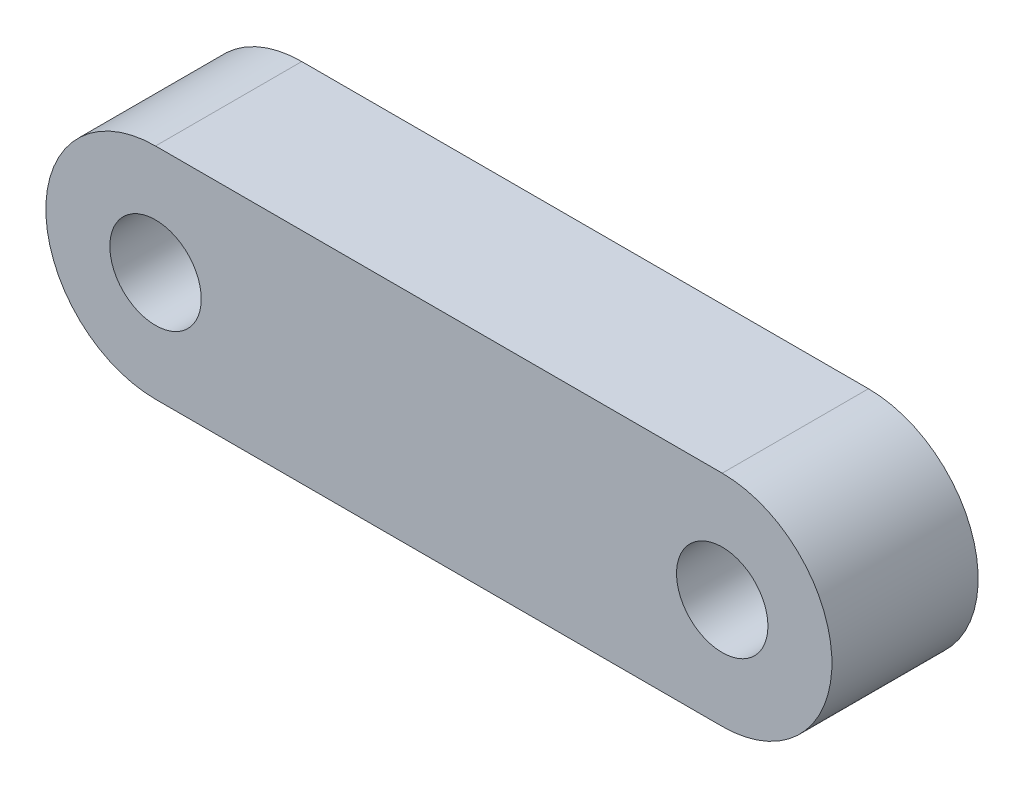
ISO-10303-21;
HEADER;
FILE_DESCRIPTION(('STEP AP214'),'2;1');
FILE_NAME('part.step','',(''),(''),'','','');
FILE_SCHEMA(('AUTOMOTIVE_DESIGN { 1 0 10303 214 1 1 1 1 }'));
ENDSEC;
DATA;
#1=APPLICATION_CONTEXT('core data for automotive mechanical design processes');
#2=APPLICATION_PROTOCOL_DEFINITION('international standard','automotive_design',2000,#1);
#3=PRODUCT_CONTEXT('',#1,'mechanical');
#4=PRODUCT('Part','Part','',(#3));
#5=PRODUCT_RELATED_PRODUCT_CATEGORY('part','',(#4));
#6=PRODUCT_DEFINITION_FORMATION('','',#4);
#7=PRODUCT_DEFINITION_CONTEXT('part definition',#1,'design');
#8=PRODUCT_DEFINITION('design','',#6,#7);
#9=PRODUCT_DEFINITION_SHAPE('','',#8);
#10=(LENGTH_UNIT() NAMED_UNIT(*) SI_UNIT(.MILLI.,.METRE.));
#11=(NAMED_UNIT(*) PLANE_ANGLE_UNIT() SI_UNIT($,.RADIAN.));
#12=(NAMED_UNIT(*) SI_UNIT($,.STERADIAN.) SOLID_ANGLE_UNIT());
#13=UNCERTAINTY_MEASURE_WITH_UNIT(LENGTH_MEASURE(1.E-05),#10,'distance_accuracy_value','');
#14=(GEOMETRIC_REPRESENTATION_CONTEXT(3) GLOBAL_UNCERTAINTY_ASSIGNED_CONTEXT((#13)) GLOBAL_UNIT_ASSIGNED_CONTEXT((#10,
#11,#12)) REPRESENTATION_CONTEXT('',''));
#15=CARTESIAN_POINT('',(0.,0.,0.));
#16=DIRECTION('',(0.,0.,1.));
#17=DIRECTION('',(1.,0.,0.));
#18=AXIS2_PLACEMENT_3D('',#15,#16,#17);
#19=CARTESIAN_POINT('',(-7.75,0.,4.));
#20=DIRECTION('',(0.,0.,-1.));
#21=DIRECTION('',(-1.,0.,0.));
#22=AXIS2_PLACEMENT_3D('',#19,#20,#21);
#23=CYLINDRICAL_SURFACE('',#22,3.);
#24=CARTESIAN_POINT('',(-7.75,0.,0.));
#25=DIRECTION('',(0.,0.,1.));
#26=DIRECTION('',(1.,0.,0.));
#27=AXIS2_PLACEMENT_3D('',#24,#25,#26);
#28=CIRCLE('',#27,3.);
#29=CARTESIAN_POINT('',(-7.75,3.,0.));
#30=VERTEX_POINT('',#29);
#31=CARTESIAN_POINT('',(-7.75,-3.,0.));
#32=VERTEX_POINT('',#31);
#33=EDGE_CURVE('E97',#30,#32,#28,.T.);
#34=ORIENTED_EDGE('',*,*,#33,.T.);
#35=DIRECTION('',(0.,0.,-1.));
#36=VECTOR('',#35,1.);
#37=CARTESIAN_POINT('',(-7.75,-3.,4.));
#38=LINE('',#37,#36);
#39=CARTESIAN_POINT('',(-7.75,-3.,4.));
#40=VERTEX_POINT('',#39);
#41=EDGE_CURVE('E11',#40,#32,#38,.T.);
#42=ORIENTED_EDGE('',*,*,#41,.F.);
#43=CARTESIAN_POINT('',(-7.75,0.,4.));
#44=DIRECTION('',(0.,0.,1.));
#45=DIRECTION('',(1.,0.,0.));
#46=AXIS2_PLACEMENT_3D('',#43,#44,#45);
#47=CIRCLE('',#46,3.);
#48=CARTESIAN_POINT('',(-7.75,3.,4.));
#49=VERTEX_POINT('',#48);
#50=EDGE_CURVE('E85',#49,#40,#47,.T.);
#51=ORIENTED_EDGE('',*,*,#50,.F.);
#52=DIRECTION('',(0.,0.,-1.));
#53=VECTOR('',#52,1.);
#54=CARTESIAN_POINT('',(-7.75,3.,4.));
#55=LINE('',#54,#53);
#56=EDGE_CURVE('E93',#49,#30,#55,.T.);
#57=ORIENTED_EDGE('',*,*,#56,.T.);
#58=EDGE_LOOP('',(#34,#42,#51,#57));
#59=FACE_BOUND('',#58,.T.);
#60=ADVANCED_FACE('F34',(#59),#23,.T.);
#61=CARTESIAN_POINT('',(-7.75,-3.,4.));
#62=DIRECTION('',(0.,1.,0.));
#63=DIRECTION('',(0.,0.,1.));
#64=AXIS2_PLACEMENT_3D('',#61,#62,#63);
#65=PLANE('',#64);
#66=DIRECTION('',(1.,0.,0.));
#67=VECTOR('',#66,1.);
#68=CARTESIAN_POINT('',(-7.75,-3.,0.));
#69=LINE('',#68,#67);
#70=CARTESIAN_POINT('',(7.75,-3.,0.));
#71=VERTEX_POINT('',#70);
#72=EDGE_CURVE('E89',#32,#71,#69,.T.);
#73=ORIENTED_EDGE('',*,*,#72,.T.);
#74=DIRECTION('',(0.,0.,-1.));
#75=VECTOR('',#74,1.);
#76=CARTESIAN_POINT('',(7.75,-3.,4.));
#77=LINE('',#76,#75);
#78=CARTESIAN_POINT('',(7.75,-3.,4.));
#79=VERTEX_POINT('',#78);
#80=EDGE_CURVE('E42',#79,#71,#77,.T.);
#81=ORIENTED_EDGE('',*,*,#80,.F.);
#82=DIRECTION('',(1.,0.,0.));
#83=VECTOR('',#82,1.);
#84=CARTESIAN_POINT('',(-7.75,-3.,4.));
#85=LINE('',#84,#83);
#86=EDGE_CURVE('E80',#40,#79,#85,.T.);
#87=ORIENTED_EDGE('',*,*,#86,.F.);
#88=ORIENTED_EDGE('',*,*,#41,.T.);
#89=EDGE_LOOP('',(#73,#81,#87,#88));
#90=FACE_BOUND('',#89,.T.);
#91=ADVANCED_FACE('F88',(#90),#65,.F.);
#92=CARTESIAN_POINT('',(7.75,0.,4.));
#93=DIRECTION('',(0.,0.,-1.));
#94=DIRECTION('',(-1.,0.,0.));
#95=AXIS2_PLACEMENT_3D('',#92,#93,#94);
#96=CYLINDRICAL_SURFACE('',#95,3.);
#97=CARTESIAN_POINT('',(7.75,0.,0.));
#98=DIRECTION('',(0.,0.,1.));
#99=DIRECTION('',(1.,0.,0.));
#100=AXIS2_PLACEMENT_3D('',#97,#98,#99);
#101=CIRCLE('',#100,3.);
#102=CARTESIAN_POINT('',(7.75,3.,0.));
#103=VERTEX_POINT('',#102);
#104=EDGE_CURVE('E67',#71,#103,#101,.T.);
#105=ORIENTED_EDGE('',*,*,#104,.T.);
#106=DIRECTION('',(0.,0.,-1.));
#107=VECTOR('',#106,1.);
#108=CARTESIAN_POINT('',(7.75,3.,4.));
#109=LINE('',#108,#107);
#110=CARTESIAN_POINT('',(7.75,3.,4.));
#111=VERTEX_POINT('',#110);
#112=EDGE_CURVE('E90',#111,#103,#109,.T.);
#113=ORIENTED_EDGE('',*,*,#112,.F.);
#114=CARTESIAN_POINT('',(7.75,0.,4.));
#115=DIRECTION('',(0.,0.,1.));
#116=DIRECTION('',(1.,0.,0.));
#117=AXIS2_PLACEMENT_3D('',#114,#115,#116);
#118=CIRCLE('',#117,3.);
#119=EDGE_CURVE('E83',#79,#111,#118,.T.);
#120=ORIENTED_EDGE('',*,*,#119,.F.);
#121=ORIENTED_EDGE('',*,*,#80,.T.);
#122=EDGE_LOOP('',(#105,#113,#120,#121));
#123=FACE_BOUND('',#122,.T.);
#124=ADVANCED_FACE('F91',(#123),#96,.T.);
#125=CARTESIAN_POINT('',(-7.75,3.,4.));
#126=DIRECTION('',(0.,-1.,0.));
#127=DIRECTION('',(0.,0.,-1.));
#128=AXIS2_PLACEMENT_3D('',#125,#126,#127);
#129=PLANE('',#128);
#130=DIRECTION('',(-1.,0.,0.));
#131=VECTOR('',#130,1.);
#132=CARTESIAN_POINT('',(-7.75,3.,0.));
#133=LINE('',#132,#131);
#134=EDGE_CURVE('E73',#103,#30,#133,.T.);
#135=ORIENTED_EDGE('',*,*,#134,.T.);
#136=ORIENTED_EDGE('',*,*,#56,.F.);
#137=DIRECTION('',(-1.,0.,0.));
#138=VECTOR('',#137,1.);
#139=CARTESIAN_POINT('',(-7.75,3.,4.));
#140=LINE('',#139,#138);
#141=EDGE_CURVE('E50',#111,#49,#140,.T.);
#142=ORIENTED_EDGE('',*,*,#141,.F.);
#143=ORIENTED_EDGE('',*,*,#112,.T.);
#144=EDGE_LOOP('',(#135,#136,#142,#143));
#145=FACE_BOUND('',#144,.T.);
#146=ADVANCED_FACE('F105',(#145),#129,.F.);
#147=CARTESIAN_POINT('',(-7.75,0.,4.));
#148=DIRECTION('',(0.,0.,1.));
#149=DIRECTION('',(1.,0.,0.));
#150=AXIS2_PLACEMENT_3D('',#147,#148,#149);
#151=PLANE('',#150);
#152=CARTESIAN_POINT('',(7.75,0.,4.));
#153=DIRECTION('',(0.,0.,1.));
#154=DIRECTION('',(1.,0.,0.));
#155=AXIS2_PLACEMENT_3D('',#152,#153,#154);
#156=CIRCLE('',#155,1.24999999999999);
#157=CARTESIAN_POINT('',(8.99999999999999,0.,4.));
#158=VERTEX_POINT('',#157);
#159=EDGE_CURVE('E119',#158,#158,#156,.T.);
#160=ORIENTED_EDGE('',*,*,#159,.F.);
#161=EDGE_LOOP('',(#160));
#162=FACE_BOUND('',#161,.T.);
#163=CARTESIAN_POINT('',(-7.75,0.,4.));
#164=DIRECTION('',(0.,0.,1.));
#165=DIRECTION('',(1.,0.,0.));
#166=AXIS2_PLACEMENT_3D('',#163,#164,#165);
#167=CIRCLE('',#166,1.24999999999999);
#168=CARTESIAN_POINT('',(-6.50000000000001,0.,4.));
#169=VERTEX_POINT('',#168);
#170=EDGE_CURVE('E113',#169,#169,#167,.T.);
#171=ORIENTED_EDGE('',*,*,#170,.F.);
#172=EDGE_LOOP('',(#171));
#173=FACE_BOUND('',#172,.T.);
#174=ORIENTED_EDGE('',*,*,#50,.T.);
#175=ORIENTED_EDGE('',*,*,#86,.T.);
#176=ORIENTED_EDGE('',*,*,#119,.T.);
#177=ORIENTED_EDGE('',*,*,#141,.T.);
#178=EDGE_LOOP('',(#174,#175,#176,#177));
#179=FACE_BOUND('',#178,.T.);
#180=ADVANCED_FACE('F81',(#162,#173,#179),#151,.T.);
#181=CARTESIAN_POINT('',(-7.75,0.,0.));
#182=DIRECTION('',(0.,0.,1.));
#183=DIRECTION('',(1.,0.,0.));
#184=AXIS2_PLACEMENT_3D('',#181,#182,#183);
#185=PLANE('',#184);
#186=CARTESIAN_POINT('',(7.75,0.,0.));
#187=DIRECTION('',(0.,0.,1.));
#188=DIRECTION('',(1.,0.,0.));
#189=AXIS2_PLACEMENT_3D('',#186,#187,#188);
#190=CIRCLE('',#189,1.24999999999999);
#191=CARTESIAN_POINT('',(8.99999999999999,0.,0.));
#192=VERTEX_POINT('',#191);
#193=EDGE_CURVE('E116',#192,#192,#190,.T.);
#194=ORIENTED_EDGE('',*,*,#193,.T.);
#195=EDGE_LOOP('',(#194));
#196=FACE_BOUND('',#195,.T.);
#197=CARTESIAN_POINT('',(-7.75,0.,0.));
#198=DIRECTION('',(0.,0.,1.));
#199=DIRECTION('',(1.,0.,0.));
#200=AXIS2_PLACEMENT_3D('',#197,#198,#199);
#201=CIRCLE('',#200,1.24999999999999);
#202=CARTESIAN_POINT('',(-6.50000000000001,0.,0.));
#203=VERTEX_POINT('',#202);
#204=EDGE_CURVE('E100',#203,#203,#201,.T.);
#205=ORIENTED_EDGE('',*,*,#204,.T.);
#206=EDGE_LOOP('',(#205));
#207=FACE_BOUND('',#206,.T.);
#208=ORIENTED_EDGE('',*,*,#33,.F.);
#209=ORIENTED_EDGE('',*,*,#134,.F.);
#210=ORIENTED_EDGE('',*,*,#104,.F.);
#211=ORIENTED_EDGE('',*,*,#72,.F.);
#212=EDGE_LOOP('',(#208,#209,#210,#211));
#213=FACE_BOUND('',#212,.T.);
#214=ADVANCED_FACE('F108',(#196,#207,#213),#185,.F.);
#215=CARTESIAN_POINT('',(-7.75,0.,4.));
#216=DIRECTION('',(0.,0.,1.));
#217=DIRECTION('',(1.,0.,0.));
#218=AXIS2_PLACEMENT_3D('',#215,#216,#217);
#219=CYLINDRICAL_SURFACE('',#218,1.24999999999999);
#220=ORIENTED_EDGE('',*,*,#204,.F.);
#221=EDGE_LOOP('',(#220));
#222=FACE_BOUND('',#221,.T.);
#223=ORIENTED_EDGE('',*,*,#170,.T.);
#224=EDGE_LOOP('',(#223));
#225=FACE_BOUND('',#224,.T.);
#226=ADVANCED_FACE('F130',(#222,#225),#219,.F.);
#227=CARTESIAN_POINT('',(7.75,0.,4.));
#228=DIRECTION('',(0.,0.,1.));
#229=DIRECTION('',(1.,0.,0.));
#230=AXIS2_PLACEMENT_3D('',#227,#228,#229);
#231=CYLINDRICAL_SURFACE('',#230,1.24999999999999);
#232=ORIENTED_EDGE('',*,*,#193,.F.);
#233=EDGE_LOOP('',(#232));
#234=FACE_BOUND('',#233,.T.);
#235=ORIENTED_EDGE('',*,*,#159,.T.);
#236=EDGE_LOOP('',(#235));
#237=FACE_BOUND('',#236,.T.);
#238=ADVANCED_FACE('F123',(#234,#237),#231,.F.);
#239=CLOSED_SHELL('',(#60,#91,#124,#146,#180,#214,#226,#238));
#240=MANIFOLD_SOLID_BREP('B2',#239);
#241=ADVANCED_BREP_SHAPE_REPRESENTATION('',(#18,#240),#14);
#242=SHAPE_DEFINITION_REPRESENTATION(#9,#241);
ENDSEC;
END-ISO-10303-21;
